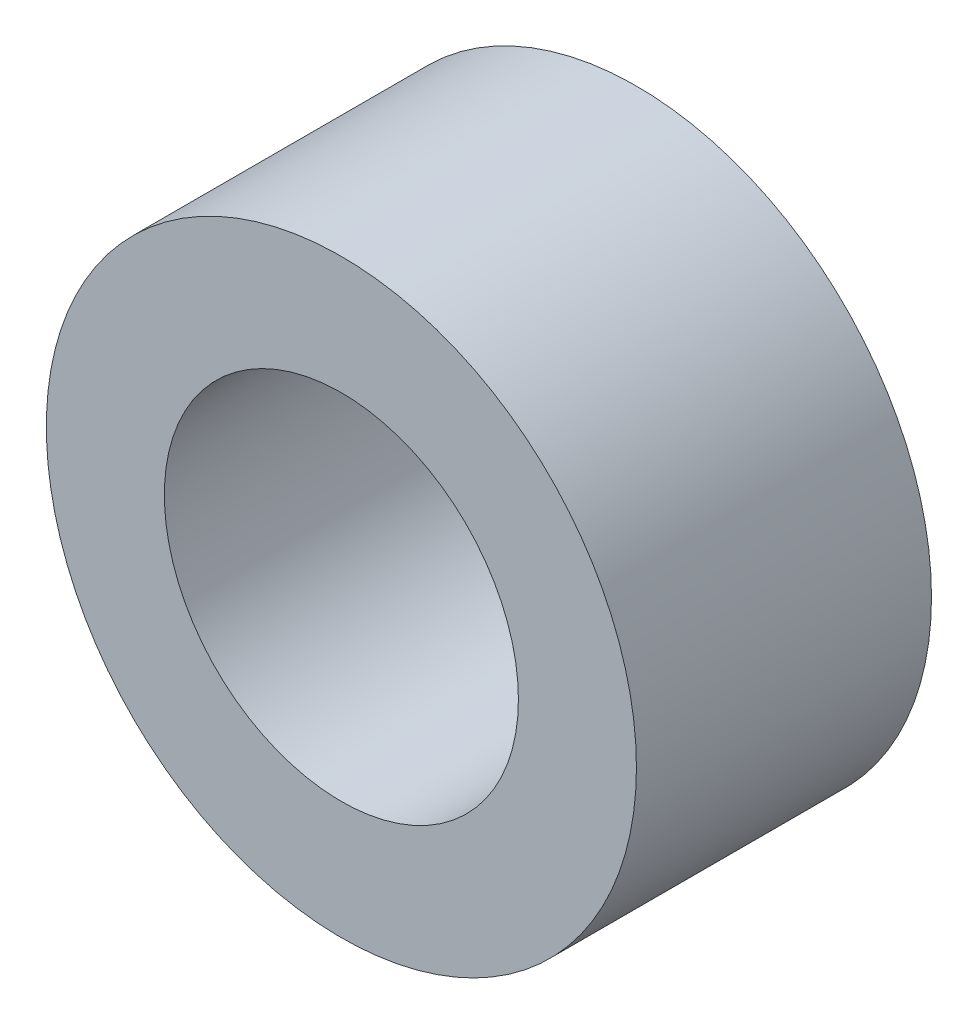
ISO-10303-21;
HEADER;
FILE_DESCRIPTION(('STEP AP214'),'2;1');
FILE_NAME('part.step','',(''),(''),'','','');
FILE_SCHEMA(('AUTOMOTIVE_DESIGN { 1 0 10303 214 1 1 1 1 }'));
ENDSEC;
DATA;
#1=APPLICATION_CONTEXT('core data for automotive mechanical design processes');
#2=APPLICATION_PROTOCOL_DEFINITION('international standard','automotive_design',2000,#1);
#3=PRODUCT_CONTEXT('',#1,'mechanical');
#4=PRODUCT('Part','Part','',(#3));
#5=PRODUCT_RELATED_PRODUCT_CATEGORY('part','',(#4));
#6=PRODUCT_DEFINITION_FORMATION('','',#4);
#7=PRODUCT_DEFINITION_CONTEXT('part definition',#1,'design');
#8=PRODUCT_DEFINITION('design','',#6,#7);
#9=PRODUCT_DEFINITION_SHAPE('','',#8);
#10=(LENGTH_UNIT() NAMED_UNIT(*) SI_UNIT(.MILLI.,.METRE.));
#11=(NAMED_UNIT(*) PLANE_ANGLE_UNIT() SI_UNIT($,.RADIAN.));
#12=(NAMED_UNIT(*) SI_UNIT($,.STERADIAN.) SOLID_ANGLE_UNIT());
#13=UNCERTAINTY_MEASURE_WITH_UNIT(LENGTH_MEASURE(1.E-05),#10,'distance_accuracy_value','');
#14=(GEOMETRIC_REPRESENTATION_CONTEXT(3) GLOBAL_UNCERTAINTY_ASSIGNED_CONTEXT((#13)) GLOBAL_UNIT_ASSIGNED_CONTEXT((#10,
#11,#12)) REPRESENTATION_CONTEXT('',''));
#15=CARTESIAN_POINT('',(0.,0.,0.));
#16=DIRECTION('',(0.,0.,1.));
#17=DIRECTION('',(1.,0.,0.));
#18=AXIS2_PLACEMENT_3D('',#15,#16,#17);
#19=CARTESIAN_POINT('',(0.,0.,2.));
#20=DIRECTION('',(0.,0.,1.));
#21=DIRECTION('',(1.,0.,0.));
#22=AXIS2_PLACEMENT_3D('',#19,#20,#21);
#23=PLANE('',#22);
#24=CARTESIAN_POINT('',(0.,0.,2.));
#25=DIRECTION('',(0.,0.,1.));
#26=DIRECTION('',(1.,0.,0.));
#27=AXIS2_PLACEMENT_3D('',#24,#25,#26);
#28=CIRCLE('',#27,2.);
#29=CARTESIAN_POINT('',(2.,0.,2.));
#30=VERTEX_POINT('',#29);
#31=EDGE_CURVE('E10',#30,#30,#28,.T.);
#32=ORIENTED_EDGE('',*,*,#31,.T.);
#33=EDGE_LOOP('',(#32));
#34=FACE_BOUND('',#33,.T.);
#35=CARTESIAN_POINT('',(0.,0.,2.));
#36=DIRECTION('',(0.,0.,1.));
#37=DIRECTION('',(1.,0.,0.));
#38=AXIS2_PLACEMENT_3D('',#35,#36,#37);
#39=CIRCLE('',#38,1.2);
#40=CARTESIAN_POINT('',(1.2,0.,2.));
#41=VERTEX_POINT('',#40);
#42=EDGE_CURVE('E44',#41,#41,#39,.T.);
#43=ORIENTED_EDGE('',*,*,#42,.F.);
#44=EDGE_LOOP('',(#43));
#45=FACE_BOUND('',#44,.T.);
#46=ADVANCED_FACE('F33',(#34,#45),#23,.T.);
#47=CARTESIAN_POINT('',(0.,0.,0.));
#48=DIRECTION('',(0.,0.,1.));
#49=DIRECTION('',(1.,0.,0.));
#50=AXIS2_PLACEMENT_3D('',#47,#48,#49);
#51=PLANE('',#50);
#52=CARTESIAN_POINT('',(0.,0.,0.));
#53=DIRECTION('',(0.,0.,1.));
#54=DIRECTION('',(1.,0.,0.));
#55=AXIS2_PLACEMENT_3D('',#52,#53,#54);
#56=CIRCLE('',#55,2.);
#57=CARTESIAN_POINT('',(2.,0.,0.));
#58=VERTEX_POINT('',#57);
#59=EDGE_CURVE('E37',#58,#58,#56,.T.);
#60=ORIENTED_EDGE('',*,*,#59,.F.);
#61=EDGE_LOOP('',(#60));
#62=FACE_BOUND('',#61,.T.);
#63=CARTESIAN_POINT('',(0.,0.,0.));
#64=DIRECTION('',(0.,0.,1.));
#65=DIRECTION('',(1.,0.,0.));
#66=AXIS2_PLACEMENT_3D('',#63,#64,#65);
#67=CIRCLE('',#66,1.2);
#68=CARTESIAN_POINT('',(1.2,0.,0.));
#69=VERTEX_POINT('',#68);
#70=EDGE_CURVE('E46',#69,#69,#67,.T.);
#71=ORIENTED_EDGE('',*,*,#70,.T.);
#72=EDGE_LOOP('',(#71));
#73=FACE_BOUND('',#72,.T.);
#74=ADVANCED_FACE('F56',(#62,#73),#51,.F.);
#75=CARTESIAN_POINT('',(0.,0.,2.));
#76=DIRECTION('',(0.,0.,-1.));
#77=DIRECTION('',(-1.,0.,0.));
#78=AXIS2_PLACEMENT_3D('',#75,#76,#77);
#79=CYLINDRICAL_SURFACE('',#78,2.);
#80=ORIENTED_EDGE('',*,*,#31,.F.);
#81=EDGE_LOOP('',(#80));
#82=FACE_BOUND('',#81,.T.);
#83=ORIENTED_EDGE('',*,*,#59,.T.);
#84=EDGE_LOOP('',(#83));
#85=FACE_BOUND('',#84,.T.);
#86=ADVANCED_FACE('F35',(#82,#85),#79,.T.);
#87=CARTESIAN_POINT('',(0.,0.,2.));
#88=DIRECTION('',(0.,0.,-1.));
#89=DIRECTION('',(-1.,0.,0.));
#90=AXIS2_PLACEMENT_3D('',#87,#88,#89);
#91=CYLINDRICAL_SURFACE('',#90,1.2);
#92=ORIENTED_EDGE('',*,*,#42,.T.);
#93=EDGE_LOOP('',(#92));
#94=FACE_BOUND('',#93,.T.);
#95=ORIENTED_EDGE('',*,*,#70,.F.);
#96=EDGE_LOOP('',(#95));
#97=FACE_BOUND('',#96,.T.);
#98=ADVANCED_FACE('F52',(#94,#97),#91,.F.);
#99=CLOSED_SHELL('',(#46,#74,#86,#98));
#100=MANIFOLD_SOLID_BREP('B2',#99);
#101=ADVANCED_BREP_SHAPE_REPRESENTATION('',(#18,#100),#14);
#102=SHAPE_DEFINITION_REPRESENTATION(#9,#101);
ENDSEC;
END-ISO-10303-21;
